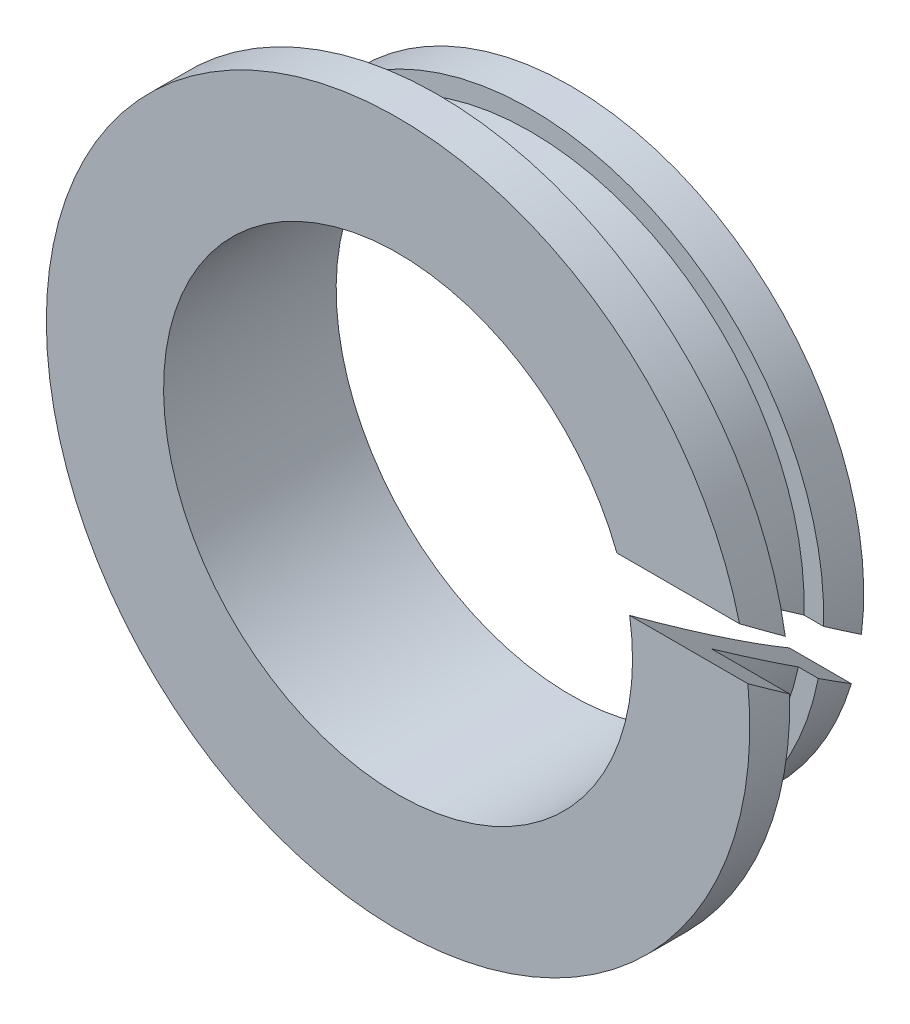
ISO-10303-21;
HEADER;
FILE_DESCRIPTION(('STEP AP214'),'2;1');
FILE_NAME('part.step','',(''),(''),'','','');
FILE_SCHEMA(('AUTOMOTIVE_DESIGN { 1 0 10303 214 1 1 1 1 }'));
ENDSEC;
DATA;
#1=APPLICATION_CONTEXT('core data for automotive mechanical design processes');
#2=APPLICATION_PROTOCOL_DEFINITION('international standard','automotive_design',2000,#1);
#3=PRODUCT_CONTEXT('',#1,'mechanical');
#4=PRODUCT('Part','Part','',(#3));
#5=PRODUCT_RELATED_PRODUCT_CATEGORY('part','',(#4));
#6=PRODUCT_DEFINITION_FORMATION('','',#4);
#7=PRODUCT_DEFINITION_CONTEXT('part definition',#1,'design');
#8=PRODUCT_DEFINITION('design','',#6,#7);
#9=PRODUCT_DEFINITION_SHAPE('','',#8);
#10=(LENGTH_UNIT() NAMED_UNIT(*) SI_UNIT(.MILLI.,.METRE.));
#11=(NAMED_UNIT(*) PLANE_ANGLE_UNIT() SI_UNIT($,.RADIAN.));
#12=(NAMED_UNIT(*) SI_UNIT($,.STERADIAN.) SOLID_ANGLE_UNIT());
#13=UNCERTAINTY_MEASURE_WITH_UNIT(LENGTH_MEASURE(1.E-05),#10,'distance_accuracy_value','');
#14=(GEOMETRIC_REPRESENTATION_CONTEXT(3) GLOBAL_UNCERTAINTY_ASSIGNED_CONTEXT((#13)) GLOBAL_UNIT_ASSIGNED_CONTEXT((#10,
#11,#12)) REPRESENTATION_CONTEXT('',''));
#15=CARTESIAN_POINT('',(0.,0.,0.));
#16=DIRECTION('',(0.,0.,1.));
#17=DIRECTION('',(1.,0.,0.));
#18=AXIS2_PLACEMENT_3D('',#15,#16,#17);
#19=CARTESIAN_POINT('',(0.,0.,0.8128));
#20=DIRECTION('',(0.,0.,-1.));
#21=DIRECTION('',(-1.,0.,0.));
#22=AXIS2_PLACEMENT_3D('',#19,#20,#21);
#23=CYLINDRICAL_SURFACE('',#22,5.953125);
#24=CARTESIAN_POINT('',(0.,0.,1.06066955298788));
#25=DIRECTION('',(0.,-0.819152044288991,0.573576436351047));
#26=DIRECTION('',(0.,-0.573576436351047,-0.819152044288991));
#27=AXIS2_PLACEMENT_3D('',#24,#25,#26);
#28=ELLIPSE('',#27,10.3789567051818,5.953125);
#29=CARTESIAN_POINT('',(5.9066158320475,-0.74268881655164,0.));
#30=VERTEX_POINT('',#29);
#31=CARTESIAN_POINT('',(5.95059443644707,-0.173560129494788,0.812799999999999));
#32=VERTEX_POINT('',#31);
#33=EDGE_CURVE('E89',#30,#32,#28,.T.);
#34=ORIENTED_EDGE('',*,*,#33,.F.);
#35=CARTESIAN_POINT('',(0.,0.,0.));
#36=DIRECTION('',(0.,0.,-1.));
#37=DIRECTION('',(-1.,0.,0.));
#38=AXIS2_PLACEMENT_3D('',#35,#36,#37);
#39=CIRCLE('',#38,5.953125);
#40=CARTESIAN_POINT('',(5.70174126711728,-1.71167864638104,0.));
#41=VERTEX_POINT('',#40);
#42=EDGE_CURVE('E60',#41,#30,#39,.T.);
#43=ORIENTED_EDGE('',*,*,#42,.F.);
#44=CARTESIAN_POINT('',(0.,0.,2.44453044701212));
#45=DIRECTION('',(0.,0.819152044288991,-0.573576436351047));
#46=DIRECTION('',(0.,-0.573576436351047,-0.819152044288991));
#47=AXIS2_PLACEMENT_3D('',#44,#45,#46);
#48=ELLIPSE('',#47,10.3789567051818,5.953125);
#49=CARTESIAN_POINT('',(5.8424546943963,-1.14254995932419,0.812799999999999));
#50=VERTEX_POINT('',#49);
#51=EDGE_CURVE('E21',#41,#50,#48,.F.);
#52=ORIENTED_EDGE('',*,*,#51,.T.);
#53=CARTESIAN_POINT('',(0.,0.,0.8128));
#54=DIRECTION('',(0.,0.,-1.));
#55=DIRECTION('',(-1.,0.,0.));
#56=AXIS2_PLACEMENT_3D('',#53,#54,#55);
#57=CIRCLE('',#56,5.953125);
#58=EDGE_CURVE('E96',#32,#50,#57,.F.);
#59=ORIENTED_EDGE('',*,*,#58,.F.);
#60=EDGE_LOOP('',(#34,#43,#52,#59));
#61=FACE_BOUND('',#60,.T.);
#62=ADVANCED_FACE('F17',(#61),#23,.T.);
#63=CARTESIAN_POINT('',(5.953125,-5.953125,0.));
#64=DIRECTION('',(0.,0.,-1.));
#65=DIRECTION('',(-1.,0.,0.));
#66=AXIS2_PLACEMENT_3D('',#63,#64,#65);
#67=PLANE('',#66);
#68=DIRECTION('',(-1.,0.,0.));
#69=VECTOR('',#68,1.);
#70=CARTESIAN_POINT('',(5.79295716493418,-1.71167864638104,0.));
#71=LINE('',#70,#69);
#72=CARTESIAN_POINT('',(4.44427299583668,-1.71167864638104,0.));
#73=VERTEX_POINT('',#72);
#74=EDGE_CURVE('E122',#41,#73,#71,.T.);
#75=ORIENTED_EDGE('',*,*,#74,.F.);
#76=ORIENTED_EDGE('',*,*,#42,.T.);
#77=DIRECTION('',(1.,0.,0.));
#78=VECTOR('',#77,1.);
#79=CARTESIAN_POINT('',(5.7480315492829,-0.74268881655164,0.));
#80=LINE('',#79,#78);
#81=CARTESIAN_POINT('',(4.70423421735878,-0.74268881655164,0.));
#82=VERTEX_POINT('',#81);
#83=EDGE_CURVE('E94',#82,#30,#80,.T.);
#84=ORIENTED_EDGE('',*,*,#83,.F.);
#85=CARTESIAN_POINT('',(0.,0.,0.));
#86=DIRECTION('',(0.,0.,1.));
#87=DIRECTION('',(1.,0.,0.));
#88=AXIS2_PLACEMENT_3D('',#85,#86,#87);
#89=CIRCLE('',#88,4.7625);
#90=EDGE_CURVE('E115',#73,#82,#89,.F.);
#91=ORIENTED_EDGE('',*,*,#90,.F.);
#92=EDGE_LOOP('',(#75,#76,#84,#91));
#93=FACE_BOUND('',#92,.T.);
#94=ADVANCED_FACE('F129',(#93),#67,.T.);
#95=CARTESIAN_POINT('',(-5.953125,-5.953125,0.8128));
#96=DIRECTION('',(0.,0.,1.));
#97=DIRECTION('',(1.,0.,0.));
#98=AXIS2_PLACEMENT_3D('',#95,#96,#97);
#99=PLANE('',#98);
#100=CARTESIAN_POINT('',(0.,0.,0.8128));
#101=DIRECTION('',(0.,0.,-1.));
#102=DIRECTION('',(-1.,0.,0.));
#103=AXIS2_PLACEMENT_3D('',#100,#101,#102);
#104=CIRCLE('',#103,5.55625);
#105=CARTESIAN_POINT('',(5.55353859660215,-0.173560129494788,0.812799999999999));
#106=VERTEX_POINT('',#105);
#107=CARTESIAN_POINT('',(5.43750803704678,-1.14254995932419,0.812799999999999));
#108=VERTEX_POINT('',#107);
#109=EDGE_CURVE('E111',#106,#108,#104,.F.);
#110=ORIENTED_EDGE('',*,*,#109,.F.);
#111=DIRECTION('',(-1.,0.,0.));
#112=VECTOR('',#111,1.);
#113=CARTESIAN_POINT('',(5.7480315492829,-0.173560129494788,0.812799999999998));
#114=LINE('',#113,#112);
#115=EDGE_CURVE('E87',#32,#106,#114,.T.);
#116=ORIENTED_EDGE('',*,*,#115,.F.);
#117=ORIENTED_EDGE('',*,*,#58,.T.);
#118=DIRECTION('',(1.,0.,0.));
#119=VECTOR('',#118,1.);
#120=CARTESIAN_POINT('',(5.79295716493418,-1.14254995932419,0.812799999999998));
#121=LINE('',#120,#119);
#122=EDGE_CURVE('E149',#108,#50,#121,.T.);
#123=ORIENTED_EDGE('',*,*,#122,.F.);
#124=EDGE_LOOP('',(#110,#116,#117,#123));
#125=FACE_BOUND('',#124,.T.);
#126=ADVANCED_FACE('F161',(#125),#99,.T.);
#127=CARTESIAN_POINT('',(4.44427299583668,-0.74268881655164,0.));
#128=DIRECTION('',(0.,-0.819152044288991,0.573576436351047));
#129=DIRECTION('',(1.,0.,0.));
#130=AXIS2_PLACEMENT_3D('',#127,#128,#129);
#131=PLANE('',#130);
#132=DIRECTION('',(1.,0.,0.));
#133=VECTOR('',#132,1.);
#134=CARTESIAN_POINT('',(0.,1.71167864638104,3.5052));
#135=LINE('',#134,#133);
#136=CARTESIAN_POINT('',(4.44427299583668,1.71167864638104,3.5052));
#137=VERTEX_POINT('',#136);
#138=CARTESIAN_POINT('',(6.93565572055182,1.71167864638104,3.5052));
#139=VERTEX_POINT('',#138);
#140=EDGE_CURVE('E107',#137,#139,#135,.T.);
#141=ORIENTED_EDGE('',*,*,#140,.F.);
#142=CARTESIAN_POINT('',(0.,0.,1.06066955298788));
#143=DIRECTION('',(0.,-0.819152044288991,0.573576436351047));
#144=DIRECTION('',(0.,0.573576436351047,0.819152044288991));
#145=AXIS2_PLACEMENT_3D('',#142,#143,#144);
#146=ELLIPSE('',#145,8.30316536414547,4.7625);
#147=EDGE_CURVE('E117',#82,#137,#146,.T.);
#148=ORIENTED_EDGE('',*,*,#147,.F.);
#149=ORIENTED_EDGE('',*,*,#83,.T.);
#150=ORIENTED_EDGE('',*,*,#33,.T.);
#151=ORIENTED_EDGE('',*,*,#115,.T.);
#152=CARTESIAN_POINT('',(0.,0.,1.06066955298788));
#153=DIRECTION('',(0.,-0.819152044288991,0.573576436351047));
#154=DIRECTION('',(0.,-0.573576436351047,-0.819152044288991));
#155=AXIS2_PLACEMENT_3D('',#152,#153,#154);
#156=ELLIPSE('',#155,9.68702625816971,5.55625);
#157=CARTESIAN_POINT('',(5.43750803704678,1.14254995932419,2.6924));
#158=VERTEX_POINT('',#157);
#159=EDGE_CURVE('E86',#158,#106,#156,.F.);
#160=ORIENTED_EDGE('',*,*,#159,.F.);
#161=DIRECTION('',(1.,0.,0.));
#162=VECTOR('',#161,1.);
#163=CARTESIAN_POINT('',(5.7480315492829,1.14254995932419,2.6924));
#164=LINE('',#163,#162);
#165=CARTESIAN_POINT('',(7.05179010272912,1.14254995932419,2.6924));
#166=VERTEX_POINT('',#165);
#167=EDGE_CURVE('E74',#158,#166,#164,.T.);
#168=ORIENTED_EDGE('',*,*,#167,.T.);
#169=CARTESIAN_POINT('',(0.,0.,1.06066955298788));
#170=DIRECTION('',(0.,-0.819152044288991,0.573576436351047));
#171=DIRECTION('',(0.,-0.573576436351047,-0.819152044288991));
#172=AXIS2_PLACEMENT_3D('',#169,#170,#171);
#173=ELLIPSE('',#172,12.4547480462182,7.14375);
#174=EDGE_CURVE('E79',#166,#139,#173,.T.);
#175=ORIENTED_EDGE('',*,*,#174,.T.);
#176=EDGE_LOOP('',(#141,#148,#149,#150,#151,#160,#168,#175));
#177=FACE_BOUND('',#176,.T.);
#178=ADVANCED_FACE('F84',(#177),#131,.T.);
#179=CARTESIAN_POINT('',(7.14164133403168,-1.71167864638104,0.));
#180=DIRECTION('',(0.,0.819152044288991,-0.573576436351047));
#181=DIRECTION('',(-1.,0.,0.));
#182=AXIS2_PLACEMENT_3D('',#179,#180,#181);
#183=PLANE('',#182);
#184=ORIENTED_EDGE('',*,*,#74,.T.);
#185=CARTESIAN_POINT('',(0.,0.,2.44453044701212));
#186=DIRECTION('',(0.,0.819152044288991,-0.573576436351047));
#187=DIRECTION('',(0.,0.573576436351047,0.819152044288991));
#188=AXIS2_PLACEMENT_3D('',#185,#186,#187);
#189=ELLIPSE('',#188,8.30316536414547,4.7625);
#190=CARTESIAN_POINT('',(4.70423421735878,0.74268881655164,3.5052));
#191=VERTEX_POINT('',#190);
#192=EDGE_CURVE('E120',#191,#73,#189,.T.);
#193=ORIENTED_EDGE('',*,*,#192,.F.);
#194=DIRECTION('',(-1.,0.,0.));
#195=VECTOR('',#194,1.);
#196=CARTESIAN_POINT('',(0.,0.74268881655164,3.5052));
#197=LINE('',#196,#195);
#198=CARTESIAN_POINT('',(7.105038872819,0.74268881655164,3.5052));
#199=VERTEX_POINT('',#198);
#200=EDGE_CURVE('E104',#199,#191,#197,.T.);
#201=ORIENTED_EDGE('',*,*,#200,.F.);
#202=CARTESIAN_POINT('',(0.,0.,2.44453044701212));
#203=DIRECTION('',(0.,0.819152044288991,-0.573576436351047));
#204=DIRECTION('',(0.,-0.573576436351047,-0.819152044288991));
#205=AXIS2_PLACEMENT_3D('',#202,#203,#204);
#206=ELLIPSE('',#205,12.4547480462182,7.14375);
#207=CARTESIAN_POINT('',(7.14164133403168,0.173560129494787,2.6924));
#208=VERTEX_POINT('',#207);
#209=EDGE_CURVE('E105',#208,#199,#206,.F.);
#210=ORIENTED_EDGE('',*,*,#209,.F.);
#211=DIRECTION('',(-1.,0.,0.));
#212=VECTOR('',#211,1.);
#213=CARTESIAN_POINT('',(5.79295716493418,0.173560129494788,2.6924));
#214=LINE('',#213,#212);
#215=CARTESIAN_POINT('',(5.55353859660215,0.173560129494787,2.6924));
#216=VERTEX_POINT('',#215);
#217=EDGE_CURVE('E77',#208,#216,#214,.T.);
#218=ORIENTED_EDGE('',*,*,#217,.T.);
#219=CARTESIAN_POINT('',(0.,0.,2.44453044701212));
#220=DIRECTION('',(0.,0.819152044288991,-0.573576436351047));
#221=DIRECTION('',(0.,-0.573576436351047,-0.819152044288991));
#222=AXIS2_PLACEMENT_3D('',#219,#220,#221);
#223=ELLIPSE('',#222,9.68702625816971,5.55625);
#224=EDGE_CURVE('E108',#108,#216,#223,.F.);
#225=ORIENTED_EDGE('',*,*,#224,.F.);
#226=ORIENTED_EDGE('',*,*,#122,.T.);
#227=ORIENTED_EDGE('',*,*,#51,.F.);
#228=EDGE_LOOP('',(#184,#193,#201,#210,#218,#225,#226,#227));
#229=FACE_BOUND('',#228,.T.);
#230=ADVANCED_FACE('F153',(#229),#183,.T.);
#231=CARTESIAN_POINT('',(0.,0.,0.));
#232=DIRECTION('',(0.,0.,1.));
#233=DIRECTION('',(1.,0.,0.));
#234=AXIS2_PLACEMENT_3D('',#231,#232,#233);
#235=CYLINDRICAL_SURFACE('',#234,4.7625);
#236=CARTESIAN_POINT('',(0.,0.,3.5052));
#237=DIRECTION('',(0.,0.,1.));
#238=DIRECTION('',(1.,0.,0.));
#239=AXIS2_PLACEMENT_3D('',#236,#237,#238);
#240=CIRCLE('',#239,4.7625);
#241=EDGE_CURVE('E101',#191,#137,#240,.F.);
#242=ORIENTED_EDGE('',*,*,#241,.F.);
#243=ORIENTED_EDGE('',*,*,#192,.T.);
#244=ORIENTED_EDGE('',*,*,#90,.T.);
#245=ORIENTED_EDGE('',*,*,#147,.T.);
#246=EDGE_LOOP('',(#242,#243,#244,#245));
#247=FACE_BOUND('',#246,.T.);
#248=ADVANCED_FACE('F136',(#247),#235,.F.);
#249=CARTESIAN_POINT('',(0.,0.,2.6924));
#250=DIRECTION('',(0.,0.,-1.));
#251=DIRECTION('',(-1.,0.,0.));
#252=AXIS2_PLACEMENT_3D('',#249,#250,#251);
#253=CYLINDRICAL_SURFACE('',#252,5.55625);
#254=ORIENTED_EDGE('',*,*,#224,.T.);
#255=CARTESIAN_POINT('',(0.,0.,2.6924));
#256=DIRECTION('',(0.,0.,-1.));
#257=DIRECTION('',(-1.,0.,0.));
#258=AXIS2_PLACEMENT_3D('',#255,#256,#257);
#259=CIRCLE('',#258,5.55625);
#260=EDGE_CURVE('E99',#158,#216,#259,.F.);
#261=ORIENTED_EDGE('',*,*,#260,.F.);
#262=ORIENTED_EDGE('',*,*,#159,.T.);
#263=ORIENTED_EDGE('',*,*,#109,.T.);
#264=EDGE_LOOP('',(#254,#261,#262,#263));
#265=FACE_BOUND('',#264,.T.);
#266=ADVANCED_FACE('F157',(#265),#253,.T.);
#267=CARTESIAN_POINT('',(-7.14375,-7.14375,3.5052));
#268=DIRECTION('',(0.,0.,1.));
#269=DIRECTION('',(1.,0.,0.));
#270=AXIS2_PLACEMENT_3D('',#267,#268,#269);
#271=PLANE('',#270);
#272=ORIENTED_EDGE('',*,*,#200,.T.);
#273=ORIENTED_EDGE('',*,*,#241,.T.);
#274=ORIENTED_EDGE('',*,*,#140,.T.);
#275=CARTESIAN_POINT('',(0.,0.,3.5052));
#276=DIRECTION('',(0.,0.,-1.));
#277=DIRECTION('',(-1.,0.,0.));
#278=AXIS2_PLACEMENT_3D('',#275,#276,#277);
#279=CIRCLE('',#278,7.14375);
#280=EDGE_CURVE('E27',#199,#139,#279,.T.);
#281=ORIENTED_EDGE('',*,*,#280,.F.);
#282=EDGE_LOOP('',(#272,#273,#274,#281));
#283=FACE_BOUND('',#282,.T.);
#284=ADVANCED_FACE('F142',(#283),#271,.T.);
#285=CARTESIAN_POINT('',(7.14375,-7.14375,2.6924));
#286=DIRECTION('',(0.,0.,-1.));
#287=DIRECTION('',(-1.,0.,0.));
#288=AXIS2_PLACEMENT_3D('',#285,#286,#287);
#289=PLANE('',#288);
#290=CARTESIAN_POINT('',(0.,0.,2.6924));
#291=DIRECTION('',(0.,0.,-1.));
#292=DIRECTION('',(-1.,0.,0.));
#293=AXIS2_PLACEMENT_3D('',#290,#291,#292);
#294=CIRCLE('',#293,7.14375);
#295=EDGE_CURVE('E11',#166,#208,#294,.F.);
#296=ORIENTED_EDGE('',*,*,#295,.F.);
#297=ORIENTED_EDGE('',*,*,#167,.F.);
#298=ORIENTED_EDGE('',*,*,#260,.T.);
#299=ORIENTED_EDGE('',*,*,#217,.F.);
#300=EDGE_LOOP('',(#296,#297,#298,#299));
#301=FACE_BOUND('',#300,.T.);
#302=ADVANCED_FACE('F70',(#301),#289,.T.);
#303=CARTESIAN_POINT('',(0.,0.,3.5052));
#304=DIRECTION('',(0.,0.,-1.));
#305=DIRECTION('',(-1.,0.,0.));
#306=AXIS2_PLACEMENT_3D('',#303,#304,#305);
#307=CYLINDRICAL_SURFACE('',#306,7.14375);
#308=ORIENTED_EDGE('',*,*,#174,.F.);
#309=ORIENTED_EDGE('',*,*,#295,.T.);
#310=ORIENTED_EDGE('',*,*,#209,.T.);
#311=ORIENTED_EDGE('',*,*,#280,.T.);
#312=EDGE_LOOP('',(#308,#309,#310,#311));
#313=FACE_BOUND('',#312,.T.);
#314=ADVANCED_FACE('F19',(#313),#307,.T.);
#315=CLOSED_SHELL('',(#62,#94,#126,#178,#230,#248,#266,#284,#302,#314));
#316=MANIFOLD_SOLID_BREP('B1',#315);
#317=ADVANCED_BREP_SHAPE_REPRESENTATION('',(#18,#316),#14);
#318=SHAPE_DEFINITION_REPRESENTATION(#9,#317);
ENDSEC;
END-ISO-10303-21;
